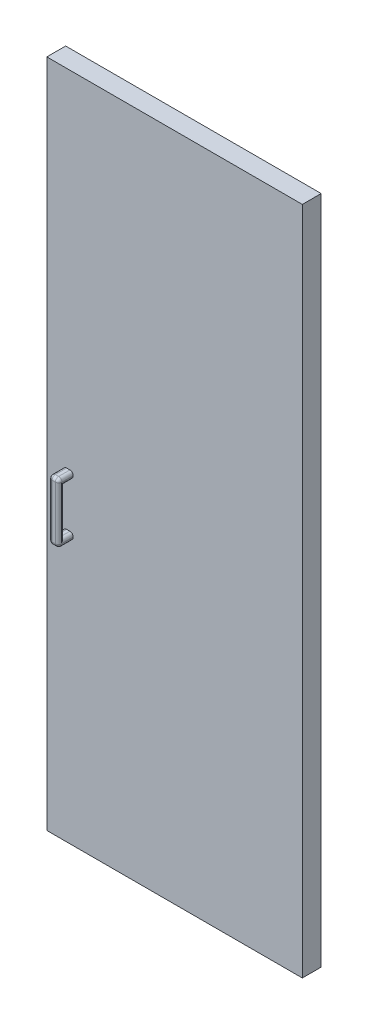
ISO-10303-21;
HEADER;
FILE_DESCRIPTION(('STEP AP214'),'2;1');
FILE_NAME('part.step','',(''),(''),'','','');
FILE_SCHEMA(('AUTOMOTIVE_DESIGN { 1 0 10303 214 1 1 1 1 }'));
ENDSEC;
DATA;
#1=APPLICATION_CONTEXT('core data for automotive mechanical design processes');
#2=APPLICATION_PROTOCOL_DEFINITION('international standard','automotive_design',2000,#1);
#3=PRODUCT_CONTEXT('',#1,'mechanical');
#4=PRODUCT('Part','Part','',(#3));
#5=PRODUCT_RELATED_PRODUCT_CATEGORY('part','',(#4));
#6=PRODUCT_DEFINITION_FORMATION('','',#4);
#7=PRODUCT_DEFINITION_CONTEXT('part definition',#1,'design');
#8=PRODUCT_DEFINITION('design','',#6,#7);
#9=PRODUCT_DEFINITION_SHAPE('','',#8);
#10=(LENGTH_UNIT() NAMED_UNIT(*) SI_UNIT(.MILLI.,.METRE.));
#11=(NAMED_UNIT(*) PLANE_ANGLE_UNIT() SI_UNIT($,.RADIAN.));
#12=(NAMED_UNIT(*) SI_UNIT($,.STERADIAN.) SOLID_ANGLE_UNIT());
#13=UNCERTAINTY_MEASURE_WITH_UNIT(LENGTH_MEASURE(1.E-05),#10,'distance_accuracy_value','');
#14=(GEOMETRIC_REPRESENTATION_CONTEXT(3) GLOBAL_UNCERTAINTY_ASSIGNED_CONTEXT((#13)) GLOBAL_UNIT_ASSIGNED_CONTEXT((#10,
#11,#12)) REPRESENTATION_CONTEXT('',''));
#15=CARTESIAN_POINT('',(0.,0.,0.));
#16=DIRECTION('',(0.,0.,1.));
#17=DIRECTION('',(1.,0.,0.));
#18=AXIS2_PLACEMENT_3D('',#15,#16,#17);
#19=CARTESIAN_POINT('',(0.,0.,0.));
#20=DIRECTION('',(0.,0.,1.));
#21=DIRECTION('',(1.,0.,0.));
#22=AXIS2_PLACEMENT_3D('',#19,#20,#21);
#23=PLANE('',#22);
#24=DIRECTION('',(-1.,0.,0.));
#25=VECTOR('',#24,1.);
#26=CARTESIAN_POINT('',(0.,446.201837212028,0.));
#27=LINE('',#26,#25);
#28=CARTESIAN_POINT('',(0.,446.201837212028,0.));
#29=VERTEX_POINT('',#28);
#30=CARTESIAN_POINT('',(-775.,446.201837212028,0.));
#31=VERTEX_POINT('',#30);
#32=EDGE_CURVE('E280',#29,#31,#27,.T.);
#33=ORIENTED_EDGE('',*,*,#32,.F.);
#34=DIRECTION('',(0.,1.,0.));
#35=VECTOR('',#34,1.);
#36=CARTESIAN_POINT('',(0.,0.,0.));
#37=LINE('',#36,#35);
#38=CARTESIAN_POINT('',(0.,-1585.79816278797,0.));
#39=VERTEX_POINT('',#38);
#40=EDGE_CURVE('E285',#39,#29,#37,.T.);
#41=ORIENTED_EDGE('',*,*,#40,.F.);
#42=DIRECTION('',(1.,0.,0.));
#43=VECTOR('',#42,1.);
#44=CARTESIAN_POINT('',(-775.,-1585.79816278797,0.));
#45=LINE('',#44,#43);
#46=CARTESIAN_POINT('',(-775.,-1585.79816278797,0.));
#47=VERTEX_POINT('',#46);
#48=EDGE_CURVE('E296',#47,#39,#45,.T.);
#49=ORIENTED_EDGE('',*,*,#48,.F.);
#50=DIRECTION('',(0.,-1.,0.));
#51=VECTOR('',#50,1.);
#52=CARTESIAN_POINT('',(-775.,446.201837212028,0.));
#53=LINE('',#52,#51);
#54=EDGE_CURVE('E294',#31,#47,#53,.T.);
#55=ORIENTED_EDGE('',*,*,#54,.F.);
#56=EDGE_LOOP('',(#33,#41,#49,#55));
#57=FACE_BOUND('',#56,.T.);
#58=DIRECTION('',(0.,1.,0.));
#59=VECTOR('',#58,1.);
#60=CARTESIAN_POINT('',(-750.,-924.798162787972,0.));
#61=LINE('',#60,#59);
#62=CARTESIAN_POINT('',(-750.,-924.798162787972,0.));
#63=VERTEX_POINT('',#62);
#64=CARTESIAN_POINT('',(-750.,-464.798162787972,0.));
#65=VERTEX_POINT('',#64);
#66=EDGE_CURVE('E244',#63,#65,#61,.T.);
#67=ORIENTED_EDGE('',*,*,#66,.F.);
#68=DIRECTION('',(-1.,0.,0.));
#69=VECTOR('',#68,1.);
#70=CARTESIAN_POINT('',(-630.,-924.798162787972,0.));
#71=LINE('',#70,#69);
#72=CARTESIAN_POINT('',(-630.,-924.798162787972,0.));
#73=VERTEX_POINT('',#72);
#74=EDGE_CURVE('E241',#73,#63,#71,.T.);
#75=ORIENTED_EDGE('',*,*,#74,.F.);
#76=DIRECTION('',(0.,-1.,0.));
#77=VECTOR('',#76,1.);
#78=CARTESIAN_POINT('',(-630.,-924.798162787972,0.));
#79=LINE('',#78,#77);
#80=CARTESIAN_POINT('',(-630.,-464.798162787972,0.));
#81=VERTEX_POINT('',#80);
#82=EDGE_CURVE('E60',#81,#73,#79,.T.);
#83=ORIENTED_EDGE('',*,*,#82,.F.);
#84=DIRECTION('',(1.,0.,0.));
#85=VECTOR('',#84,1.);
#86=CARTESIAN_POINT('',(-630.,-464.798162787972,0.));
#87=LINE('',#86,#85);
#88=EDGE_CURVE('E55',#65,#81,#87,.T.);
#89=ORIENTED_EDGE('',*,*,#88,.F.);
#90=EDGE_LOOP('',(#67,#75,#83,#89));
#91=FACE_BOUND('',#90,.T.);
#92=ADVANCED_FACE('F38',(#57,#91),#23,.F.);
#93=CARTESIAN_POINT('',(-695.,-603.798162787972,101.15));
#94=DIRECTION('',(-1.,0.,0.));
#95=DIRECTION('',(0.,-1.,0.));
#96=AXIS2_PLACEMENT_3D('',#93,#94,#95);
#97=PLANE('',#96);
#98=DIRECTION('',(0.,1.,0.));
#99=VECTOR('',#98,1.);
#100=CARTESIAN_POINT('',(-695.,-603.798162787972,57.15));
#101=LINE('',#100,#99);
#102=CARTESIAN_POINT('',(-695.,-614.798162787972,57.15));
#103=VERTEX_POINT('',#102);
#104=CARTESIAN_POINT('',(-695.,-613.798162787972,57.15));
#105=VERTEX_POINT('',#104);
#106=EDGE_CURVE('E273',#103,#105,#101,.T.);
#107=ORIENTED_EDGE('',*,*,#106,.T.);
#108=DIRECTION('',(0.,0.,-1.));
#109=VECTOR('',#108,1.);
#110=CARTESIAN_POINT('',(-695.,-613.798162787972,101.15));
#111=LINE('',#110,#109);
#112=CARTESIAN_POINT('',(-695.,-613.798162787972,91.15));
#113=VERTEX_POINT('',#112);
#114=EDGE_CURVE('E349',#105,#113,#111,.F.);
#115=ORIENTED_EDGE('',*,*,#114,.T.);
#116=DIRECTION('',(0.,1.,0.));
#117=VECTOR('',#116,1.);
#118=CARTESIAN_POINT('',(-695.,-785.798162787972,91.15));
#119=LINE('',#118,#117);
#120=CARTESIAN_POINT('',(-695.,-614.798162787972,91.15));
#121=VERTEX_POINT('',#120);
#122=EDGE_CURVE('E345',#113,#121,#119,.F.);
#123=ORIENTED_EDGE('',*,*,#122,.T.);
#124=DIRECTION('',(0.,0.,-1.));
#125=VECTOR('',#124,1.);
#126=CARTESIAN_POINT('',(-695.,-614.798162787972,101.15));
#127=LINE('',#126,#125);
#128=EDGE_CURVE('E347',#121,#103,#127,.T.);
#129=ORIENTED_EDGE('',*,*,#128,.T.);
#130=EDGE_LOOP('',(#107,#115,#123,#129));
#131=FACE_BOUND('',#130,.T.);
#132=ADVANCED_FACE('F551',(#131),#97,.F.);
#133=CARTESIAN_POINT('',(-725.,-603.798162787972,101.15));
#134=DIRECTION('',(1.,0.,0.));
#135=DIRECTION('',(0.,0.,-1.));
#136=AXIS2_PLACEMENT_3D('',#133,#134,#135);
#137=PLANE('',#136);
#138=DIRECTION('',(0.,-1.,0.));
#139=VECTOR('',#138,1.);
#140=CARTESIAN_POINT('',(-725.,-603.798162787972,91.15));
#141=LINE('',#140,#139);
#142=CARTESIAN_POINT('',(-725.,-614.798162787972,91.15));
#143=VERTEX_POINT('',#142);
#144=CARTESIAN_POINT('',(-725.,-613.798162787972,91.15));
#145=VERTEX_POINT('',#144);
#146=EDGE_CURVE('E317',#143,#145,#141,.F.);
#147=ORIENTED_EDGE('',*,*,#146,.T.);
#148=DIRECTION('',(0.,0.,-1.));
#149=VECTOR('',#148,1.);
#150=CARTESIAN_POINT('',(-725.,-613.798162787972,101.15));
#151=LINE('',#150,#149);
#152=CARTESIAN_POINT('',(-725.,-613.798162787972,57.15));
#153=VERTEX_POINT('',#152);
#154=EDGE_CURVE('E321',#145,#153,#151,.T.);
#155=ORIENTED_EDGE('',*,*,#154,.T.);
#156=DIRECTION('',(0.,-1.,0.));
#157=VECTOR('',#156,1.);
#158=CARTESIAN_POINT('',(-725.,-603.798162787972,57.15));
#159=LINE('',#158,#157);
#160=CARTESIAN_POINT('',(-725.,-614.798162787972,57.15));
#161=VERTEX_POINT('',#160);
#162=EDGE_CURVE('E269',#153,#161,#159,.T.);
#163=ORIENTED_EDGE('',*,*,#162,.T.);
#164=DIRECTION('',(0.,0.,-1.));
#165=VECTOR('',#164,1.);
#166=CARTESIAN_POINT('',(-725.,-614.798162787972,101.15));
#167=LINE('',#166,#165);
#168=EDGE_CURVE('E319',#161,#143,#167,.F.);
#169=ORIENTED_EDGE('',*,*,#168,.T.);
#170=EDGE_LOOP('',(#147,#155,#163,#169));
#171=FACE_BOUND('',#170,.T.);
#172=ADVANCED_FACE('F518',(#171),#137,.F.);
#173=CARTESIAN_POINT('',(0.,0.,57.15));
#174=DIRECTION('',(0.,0.,1.));
#175=DIRECTION('',(1.,0.,0.));
#176=AXIS2_PLACEMENT_3D('',#173,#174,#175);
#177=PLANE('',#176);
#178=ORIENTED_EDGE('',*,*,#106,.F.);
#179=CARTESIAN_POINT('',(-705.,-614.798162787972,57.15));
#180=DIRECTION('',(0.,0.,1.));
#181=DIRECTION('',(1.,0.,0.));
#182=AXIS2_PLACEMENT_3D('',#179,#180,#181);
#183=CIRCLE('',#182,10.);
#184=CARTESIAN_POINT('',(-705.,-624.798162787972,57.15));
#185=VERTEX_POINT('',#184);
#186=EDGE_CURVE('E373',#103,#185,#183,.F.);
#187=ORIENTED_EDGE('',*,*,#186,.T.);
#188=DIRECTION('',(-1.,0.,0.));
#189=VECTOR('',#188,1.);
#190=CARTESIAN_POINT('',(-667.85,-624.798162787972,57.15));
#191=LINE('',#190,#189);
#192=CARTESIAN_POINT('',(-715.,-624.798162787972,57.15));
#193=VERTEX_POINT('',#192);
#194=EDGE_CURVE('E254',#185,#193,#191,.T.);
#195=ORIENTED_EDGE('',*,*,#194,.T.);
#196=CARTESIAN_POINT('',(-715.,-614.798162787972,57.15));
#197=DIRECTION('',(0.,0.,1.));
#198=DIRECTION('',(1.,0.,0.));
#199=AXIS2_PLACEMENT_3D('',#196,#197,#198);
#200=CIRCLE('',#199,10.);
#201=EDGE_CURVE('E375',#193,#161,#200,.F.);
#202=ORIENTED_EDGE('',*,*,#201,.T.);
#203=ORIENTED_EDGE('',*,*,#162,.F.);
#204=CARTESIAN_POINT('',(-715.,-613.798162787972,57.15));
#205=DIRECTION('',(0.,0.,1.));
#206=DIRECTION('',(1.,0.,0.));
#207=AXIS2_PLACEMENT_3D('',#204,#205,#206);
#208=CIRCLE('',#207,10.);
#209=CARTESIAN_POINT('',(-715.,-603.798162787972,57.15));
#210=VERTEX_POINT('',#209);
#211=EDGE_CURVE('E369',#153,#210,#208,.F.);
#212=ORIENTED_EDGE('',*,*,#211,.T.);
#213=DIRECTION('',(-1.,0.,0.));
#214=VECTOR('',#213,1.);
#215=CARTESIAN_POINT('',(-725.,-603.798162787972,57.15));
#216=LINE('',#215,#214);
#217=CARTESIAN_POINT('',(-705.,-603.798162787972,57.15));
#218=VERTEX_POINT('',#217);
#219=EDGE_CURVE('E277',#218,#210,#216,.T.);
#220=ORIENTED_EDGE('',*,*,#219,.F.);
#221=CARTESIAN_POINT('',(-705.,-613.798162787972,57.15));
#222=DIRECTION('',(0.,0.,1.));
#223=DIRECTION('',(1.,0.,0.));
#224=AXIS2_PLACEMENT_3D('',#221,#222,#223);
#225=CIRCLE('',#224,10.);
#226=EDGE_CURVE('E371',#218,#105,#225,.F.);
#227=ORIENTED_EDGE('',*,*,#226,.T.);
#228=EDGE_LOOP('',(#178,#187,#195,#202,#203,#212,#220,#227));
#229=FACE_BOUND('',#228,.T.);
#230=DIRECTION('',(-1.,0.,0.));
#231=VECTOR('',#230,1.);
#232=CARTESIAN_POINT('',(-667.85,-764.798162787972,57.15));
#233=LINE('',#232,#231);
#234=CARTESIAN_POINT('',(-705.,-764.798162787972,57.15));
#235=VERTEX_POINT('',#234);
#236=CARTESIAN_POINT('',(-715.,-764.798162787972,57.15));
#237=VERTEX_POINT('',#236);
#238=EDGE_CURVE('E264',#235,#237,#233,.T.);
#239=ORIENTED_EDGE('',*,*,#238,.F.);
#240=CARTESIAN_POINT('',(-705.,-774.798162787972,57.15));
#241=DIRECTION('',(0.,0.,1.));
#242=DIRECTION('',(1.,0.,0.));
#243=AXIS2_PLACEMENT_3D('',#240,#241,#242);
#244=CIRCLE('',#243,10.);
#245=CARTESIAN_POINT('',(-695.,-774.798162787972,57.15));
#246=VERTEX_POINT('',#245);
#247=EDGE_CURVE('E377',#235,#246,#244,.F.);
#248=ORIENTED_EDGE('',*,*,#247,.T.);
#249=CARTESIAN_POINT('',(-695.,-775.798162787972,57.15));
#250=VERTEX_POINT('',#249);
#251=EDGE_CURVE('E274',#250,#246,#101,.T.);
#252=ORIENTED_EDGE('',*,*,#251,.F.);
#253=CARTESIAN_POINT('',(-705.,-775.798162787972,57.15));
#254=DIRECTION('',(0.,0.,1.));
#255=DIRECTION('',(1.,0.,0.));
#256=AXIS2_PLACEMENT_3D('',#253,#254,#255);
#257=CIRCLE('',#256,10.);
#258=CARTESIAN_POINT('',(-705.,-785.798162787972,57.15));
#259=VERTEX_POINT('',#258);
#260=EDGE_CURVE('E11',#250,#259,#257,.F.);
#261=ORIENTED_EDGE('',*,*,#260,.T.);
#262=DIRECTION('',(1.,0.,0.));
#263=VECTOR('',#262,1.);
#264=CARTESIAN_POINT('',(-725.,-785.798162787972,57.15));
#265=LINE('',#264,#263);
#266=CARTESIAN_POINT('',(-715.,-785.798162787972,57.15));
#267=VERTEX_POINT('',#266);
#268=EDGE_CURVE('E270',#267,#259,#265,.T.);
#269=ORIENTED_EDGE('',*,*,#268,.F.);
#270=CARTESIAN_POINT('',(-715.,-775.798162787972,57.15));
#271=DIRECTION('',(0.,0.,1.));
#272=DIRECTION('',(1.,0.,0.));
#273=AXIS2_PLACEMENT_3D('',#270,#271,#272);
#274=CIRCLE('',#273,10.);
#275=CARTESIAN_POINT('',(-725.,-775.798162787972,57.15));
#276=VERTEX_POINT('',#275);
#277=EDGE_CURVE('E47',#267,#276,#274,.F.);
#278=ORIENTED_EDGE('',*,*,#277,.T.);
#279=CARTESIAN_POINT('',(-725.,-774.798162787972,57.15));
#280=VERTEX_POINT('',#279);
#281=EDGE_CURVE('E257',#280,#276,#159,.T.);
#282=ORIENTED_EDGE('',*,*,#281,.F.);
#283=CARTESIAN_POINT('',(-715.,-774.798162787972,57.15));
#284=DIRECTION('',(0.,0.,1.));
#285=DIRECTION('',(1.,0.,0.));
#286=AXIS2_PLACEMENT_3D('',#283,#284,#285);
#287=CIRCLE('',#286,10.);
#288=EDGE_CURVE('E379',#280,#237,#287,.F.);
#289=ORIENTED_EDGE('',*,*,#288,.T.);
#290=EDGE_LOOP('',(#239,#248,#252,#261,#269,#278,#282,#289));
#291=FACE_BOUND('',#290,.T.);
#292=DIRECTION('',(-1.,0.,0.));
#293=VECTOR('',#292,1.);
#294=CARTESIAN_POINT('',(0.,446.201837212028,57.15));
#295=LINE('',#294,#293);
#296=CARTESIAN_POINT('',(0.,446.201837212028,57.15));
#297=VERTEX_POINT('',#296);
#298=CARTESIAN_POINT('',(-775.,446.201837212028,57.15));
#299=VERTEX_POINT('',#298);
#300=EDGE_CURVE('E281',#297,#299,#295,.T.);
#301=ORIENTED_EDGE('',*,*,#300,.T.);
#302=DIRECTION('',(0.,-1.,0.));
#303=VECTOR('',#302,1.);
#304=CARTESIAN_POINT('',(-775.,446.201837212028,57.15));
#305=LINE('',#304,#303);
#306=CARTESIAN_POINT('',(-775.,-1585.79816278797,57.15));
#307=VERTEX_POINT('',#306);
#308=EDGE_CURVE('E284',#299,#307,#305,.T.);
#309=ORIENTED_EDGE('',*,*,#308,.T.);
#310=DIRECTION('',(1.,0.,0.));
#311=VECTOR('',#310,1.);
#312=CARTESIAN_POINT('',(-775.,-1585.79816278797,57.15));
#313=LINE('',#312,#311);
#314=CARTESIAN_POINT('',(0.,-1585.79816278797,57.15));
#315=VERTEX_POINT('',#314);
#316=EDGE_CURVE('E287',#307,#315,#313,.T.);
#317=ORIENTED_EDGE('',*,*,#316,.T.);
#318=DIRECTION('',(0.,1.,0.));
#319=VECTOR('',#318,1.);
#320=CARTESIAN_POINT('',(0.,-1585.79816278797,57.15));
#321=LINE('',#320,#319);
#322=EDGE_CURVE('E289',#315,#297,#321,.T.);
#323=ORIENTED_EDGE('',*,*,#322,.T.);
#324=EDGE_LOOP('',(#301,#309,#317,#323));
#325=FACE_BOUND('',#324,.T.);
#326=ADVANCED_FACE('F464',(#229,#291,#325),#177,.T.);
#327=CARTESIAN_POINT('',(0.,446.201837212028,57.15));
#328=DIRECTION('',(0.,-1.,0.));
#329=DIRECTION('',(1.,0.,0.));
#330=AXIS2_PLACEMENT_3D('',#327,#328,#329);
#331=PLANE('',#330);
#332=ORIENTED_EDGE('',*,*,#32,.T.);
#333=DIRECTION('',(0.,0.,-1.));
#334=VECTOR('',#333,1.);
#335=CARTESIAN_POINT('',(-775.,446.201837212028,57.15));
#336=LINE('',#335,#334);
#337=EDGE_CURVE('E308',#299,#31,#336,.T.);
#338=ORIENTED_EDGE('',*,*,#337,.F.);
#339=ORIENTED_EDGE('',*,*,#300,.F.);
#340=DIRECTION('',(0.,0.,-1.));
#341=VECTOR('',#340,1.);
#342=CARTESIAN_POINT('',(0.,446.201837212028,57.15));
#343=LINE('',#342,#341);
#344=EDGE_CURVE('E291',#297,#29,#343,.T.);
#345=ORIENTED_EDGE('',*,*,#344,.T.);
#346=EDGE_LOOP('',(#332,#338,#339,#345));
#347=FACE_BOUND('',#346,.T.);
#348=ADVANCED_FACE('F574',(#347),#331,.F.);
#349=CARTESIAN_POINT('',(-775.,446.201837212028,57.15));
#350=DIRECTION('',(1.,0.,0.));
#351=DIRECTION('',(0.,1.,0.));
#352=AXIS2_PLACEMENT_3D('',#349,#350,#351);
#353=PLANE('',#352);
#354=ORIENTED_EDGE('',*,*,#54,.T.);
#355=DIRECTION('',(0.,0.,-1.));
#356=VECTOR('',#355,1.);
#357=CARTESIAN_POINT('',(-775.,-1585.79816278797,57.15));
#358=LINE('',#357,#356);
#359=EDGE_CURVE('E305',#307,#47,#358,.T.);
#360=ORIENTED_EDGE('',*,*,#359,.F.);
#361=ORIENTED_EDGE('',*,*,#308,.F.);
#362=ORIENTED_EDGE('',*,*,#337,.T.);
#363=EDGE_LOOP('',(#354,#360,#361,#362));
#364=FACE_BOUND('',#363,.T.);
#365=ADVANCED_FACE('F582',(#364),#353,.F.);
#366=CARTESIAN_POINT('',(-775.,-1585.79816278797,57.15));
#367=DIRECTION('',(0.,1.,0.));
#368=DIRECTION('',(0.,0.,1.));
#369=AXIS2_PLACEMENT_3D('',#366,#367,#368);
#370=PLANE('',#369);
#371=ORIENTED_EDGE('',*,*,#48,.T.);
#372=DIRECTION('',(0.,0.,-1.));
#373=VECTOR('',#372,1.);
#374=CARTESIAN_POINT('',(0.,-1585.79816278797,57.15));
#375=LINE('',#374,#373);
#376=EDGE_CURVE('E302',#315,#39,#375,.T.);
#377=ORIENTED_EDGE('',*,*,#376,.F.);
#378=ORIENTED_EDGE('',*,*,#316,.F.);
#379=ORIENTED_EDGE('',*,*,#359,.T.);
#380=EDGE_LOOP('',(#371,#377,#378,#379));
#381=FACE_BOUND('',#380,.T.);
#382=ADVANCED_FACE('F578',(#381),#370,.F.);
#383=CARTESIAN_POINT('',(0.,0.,57.15));
#384=DIRECTION('',(-1.,0.,0.));
#385=DIRECTION('',(0.,0.,1.));
#386=AXIS2_PLACEMENT_3D('',#383,#384,#385);
#387=PLANE('',#386);
#388=ORIENTED_EDGE('',*,*,#40,.T.);
#389=ORIENTED_EDGE('',*,*,#344,.F.);
#390=ORIENTED_EDGE('',*,*,#322,.F.);
#391=ORIENTED_EDGE('',*,*,#376,.T.);
#392=EDGE_LOOP('',(#388,#389,#390,#391));
#393=FACE_BOUND('',#392,.T.);
#394=ADVANCED_FACE('F571',(#393),#387,.F.);
#395=DIRECTION('',(0.,-1.,0.));
#396=VECTOR('',#395,1.);
#397=CARTESIAN_POINT('',(-725.,-603.798162787972,91.15));
#398=LINE('',#397,#396);
#399=CARTESIAN_POINT('',(-725.,-775.798162787972,91.15));
#400=VERTEX_POINT('',#399);
#401=CARTESIAN_POINT('',(-725.,-774.798162787972,91.15));
#402=VERTEX_POINT('',#401);
#403=EDGE_CURVE('E313',#400,#402,#398,.F.);
#404=ORIENTED_EDGE('',*,*,#403,.T.);
#405=DIRECTION('',(0.,0.,1.));
#406=VECTOR('',#405,1.);
#407=CARTESIAN_POINT('',(-725.,-774.798162787972,101.15));
#408=LINE('',#407,#406);
#409=EDGE_CURVE('E315',#402,#280,#408,.F.);
#410=ORIENTED_EDGE('',*,*,#409,.T.);
#411=ORIENTED_EDGE('',*,*,#281,.T.);
#412=DIRECTION('',(0.,0.,-1.));
#413=VECTOR('',#412,1.);
#414=CARTESIAN_POINT('',(-725.,-775.798162787972,101.15));
#415=LINE('',#414,#413);
#416=EDGE_CURVE('E311',#276,#400,#415,.F.);
#417=ORIENTED_EDGE('',*,*,#416,.T.);
#418=EDGE_LOOP('',(#404,#410,#411,#417));
#419=FACE_BOUND('',#418,.T.);
#420=ADVANCED_FACE('F484',(#419),#137,.F.);
#421=CARTESIAN_POINT('',(-725.,-785.798162787972,101.15));
#422=DIRECTION('',(0.,1.,0.));
#423=DIRECTION('',(0.,0.,1.));
#424=AXIS2_PLACEMENT_3D('',#421,#422,#423);
#425=PLANE('',#424);
#426=DIRECTION('',(1.,0.,0.));
#427=VECTOR('',#426,1.);
#428=CARTESIAN_POINT('',(-725.,-785.798162787972,91.15));
#429=LINE('',#428,#427);
#430=CARTESIAN_POINT('',(-705.,-785.798162787972,91.15));
#431=VERTEX_POINT('',#430);
#432=CARTESIAN_POINT('',(-715.,-785.798162787972,91.15));
#433=VERTEX_POINT('',#432);
#434=EDGE_CURVE('E363',#431,#433,#429,.F.);
#435=ORIENTED_EDGE('',*,*,#434,.T.);
#436=DIRECTION('',(0.,0.,-1.));
#437=VECTOR('',#436,1.);
#438=CARTESIAN_POINT('',(-715.,-785.798162787972,101.15));
#439=LINE('',#438,#437);
#440=EDGE_CURVE('E367',#433,#267,#439,.T.);
#441=ORIENTED_EDGE('',*,*,#440,.T.);
#442=ORIENTED_EDGE('',*,*,#268,.T.);
#443=DIRECTION('',(0.,0.,-1.));
#444=VECTOR('',#443,1.);
#445=CARTESIAN_POINT('',(-705.,-785.798162787972,101.15));
#446=LINE('',#445,#444);
#447=EDGE_CURVE('E365',#259,#431,#446,.F.);
#448=ORIENTED_EDGE('',*,*,#447,.T.);
#449=EDGE_LOOP('',(#435,#441,#442,#448));
#450=FACE_BOUND('',#449,.T.);
#451=ADVANCED_FACE('F472',(#450),#425,.F.);
#452=ORIENTED_EDGE('',*,*,#251,.T.);
#453=DIRECTION('',(0.,0.,1.));
#454=VECTOR('',#453,1.);
#455=CARTESIAN_POINT('',(-695.,-774.798162787972,101.15));
#456=LINE('',#455,#454);
#457=CARTESIAN_POINT('',(-695.,-774.798162787972,91.15));
#458=VERTEX_POINT('',#457);
#459=EDGE_CURVE('E343',#246,#458,#456,.T.);
#460=ORIENTED_EDGE('',*,*,#459,.T.);
#461=DIRECTION('',(0.,1.,0.));
#462=VECTOR('',#461,1.);
#463=CARTESIAN_POINT('',(-695.,-785.798162787972,91.15));
#464=LINE('',#463,#462);
#465=CARTESIAN_POINT('',(-695.,-775.798162787972,91.15));
#466=VERTEX_POINT('',#465);
#467=EDGE_CURVE('E339',#458,#466,#464,.F.);
#468=ORIENTED_EDGE('',*,*,#467,.T.);
#469=DIRECTION('',(0.,0.,-1.));
#470=VECTOR('',#469,1.);
#471=CARTESIAN_POINT('',(-695.,-775.798162787972,101.15));
#472=LINE('',#471,#470);
#473=EDGE_CURVE('E341',#466,#250,#472,.T.);
#474=ORIENTED_EDGE('',*,*,#473,.T.);
#475=EDGE_LOOP('',(#452,#460,#468,#474));
#476=FACE_BOUND('',#475,.T.);
#477=ADVANCED_FACE('F458',(#476),#97,.F.);
#478=CARTESIAN_POINT('',(-725.,-603.798162787972,101.15));
#479=DIRECTION('',(0.,-1.,0.));
#480=DIRECTION('',(1.,0.,0.));
#481=AXIS2_PLACEMENT_3D('',#478,#479,#480);
#482=PLANE('',#481);
#483=ORIENTED_EDGE('',*,*,#219,.T.);
#484=DIRECTION('',(0.,0.,-1.));
#485=VECTOR('',#484,1.);
#486=CARTESIAN_POINT('',(-715.,-603.798162787972,101.15));
#487=LINE('',#486,#485);
#488=CARTESIAN_POINT('',(-715.,-603.798162787972,91.15));
#489=VERTEX_POINT('',#488);
#490=EDGE_CURVE('E328',#210,#489,#487,.F.);
#491=ORIENTED_EDGE('',*,*,#490,.T.);
#492=DIRECTION('',(-1.,0.,0.));
#493=VECTOR('',#492,1.);
#494=CARTESIAN_POINT('',(-695.,-603.798162787972,91.15));
#495=LINE('',#494,#493);
#496=CARTESIAN_POINT('',(-705.,-603.798162787972,91.15));
#497=VERTEX_POINT('',#496);
#498=EDGE_CURVE('E326',#489,#497,#495,.F.);
#499=ORIENTED_EDGE('',*,*,#498,.T.);
#500=DIRECTION('',(0.,0.,-1.));
#501=VECTOR('',#500,1.);
#502=CARTESIAN_POINT('',(-705.,-603.798162787972,101.15));
#503=LINE('',#502,#501);
#504=EDGE_CURVE('E324',#497,#218,#503,.T.);
#505=ORIENTED_EDGE('',*,*,#504,.T.);
#506=EDGE_LOOP('',(#483,#491,#499,#505));
#507=FACE_BOUND('',#506,.T.);
#508=ADVANCED_FACE('F529',(#507),#482,.F.);
#509=CARTESIAN_POINT('',(0.,0.,101.15));
#510=DIRECTION('',(0.,0.,1.));
#511=DIRECTION('',(1.,0.,0.));
#512=AXIS2_PLACEMENT_3D('',#509,#510,#511);
#513=PLANE('',#512);
#514=DIRECTION('',(0.,1.,0.));
#515=VECTOR('',#514,1.);
#516=CARTESIAN_POINT('',(-705.,-603.798162787972,101.15));
#517=LINE('',#516,#515);
#518=CARTESIAN_POINT('',(-705.,-775.798162787972,101.15));
#519=VERTEX_POINT('',#518);
#520=CARTESIAN_POINT('',(-705.,-613.798162787972,101.15));
#521=VERTEX_POINT('',#520);
#522=EDGE_CURVE('E332',#519,#521,#517,.T.);
#523=ORIENTED_EDGE('',*,*,#522,.T.);
#524=DIRECTION('',(-1.,0.,0.));
#525=VECTOR('',#524,1.);
#526=CARTESIAN_POINT('',(-725.,-613.798162787972,101.15));
#527=LINE('',#526,#525);
#528=CARTESIAN_POINT('',(-715.,-613.798162787972,101.15));
#529=VERTEX_POINT('',#528);
#530=EDGE_CURVE('E336',#521,#529,#527,.T.);
#531=ORIENTED_EDGE('',*,*,#530,.T.);
#532=DIRECTION('',(0.,-1.,0.));
#533=VECTOR('',#532,1.);
#534=CARTESIAN_POINT('',(-715.,-785.798162787972,101.15));
#535=LINE('',#534,#533);
#536=CARTESIAN_POINT('',(-715.,-775.798162787972,101.15));
#537=VERTEX_POINT('',#536);
#538=EDGE_CURVE('E334',#529,#537,#535,.T.);
#539=ORIENTED_EDGE('',*,*,#538,.T.);
#540=DIRECTION('',(1.,0.,0.));
#541=VECTOR('',#540,1.);
#542=CARTESIAN_POINT('',(-695.,-775.798162787972,101.15));
#543=LINE('',#542,#541);
#544=EDGE_CURVE('E330',#537,#519,#543,.T.);
#545=ORIENTED_EDGE('',*,*,#544,.T.);
#546=EDGE_LOOP('',(#523,#531,#539,#545));
#547=FACE_BOUND('',#546,.T.);
#548=ADVANCED_FACE('F546',(#547),#513,.T.);
#549=CARTESIAN_POINT('',(-667.85,-624.798162787972,83.15));
#550=DIRECTION('',(0.,1.,0.));
#551=DIRECTION('',(0.,0.,1.));
#552=AXIS2_PLACEMENT_3D('',#549,#550,#551);
#553=PLANE('',#552);
#554=ORIENTED_EDGE('',*,*,#194,.F.);
#555=DIRECTION('',(0.,0.,-1.));
#556=VECTOR('',#555,1.);
#557=CARTESIAN_POINT('',(-705.,-624.798162787972,83.15));
#558=LINE('',#557,#556);
#559=CARTESIAN_POINT('',(-705.,-624.798162787972,83.15));
#560=VERTEX_POINT('',#559);
#561=EDGE_CURVE('E353',#185,#560,#558,.F.);
#562=ORIENTED_EDGE('',*,*,#561,.T.);
#563=DIRECTION('',(-1.,0.,0.));
#564=VECTOR('',#563,1.);
#565=CARTESIAN_POINT('',(-667.85,-624.798162787972,83.15));
#566=LINE('',#565,#564);
#567=CARTESIAN_POINT('',(-715.,-624.798162787972,83.15));
#568=VERTEX_POINT('',#567);
#569=EDGE_CURVE('E258',#560,#568,#566,.T.);
#570=ORIENTED_EDGE('',*,*,#569,.T.);
#571=DIRECTION('',(0.,0.,-1.));
#572=VECTOR('',#571,1.);
#573=CARTESIAN_POINT('',(-715.,-624.798162787972,83.15));
#574=LINE('',#573,#572);
#575=EDGE_CURVE('E351',#568,#193,#574,.T.);
#576=ORIENTED_EDGE('',*,*,#575,.T.);
#577=EDGE_LOOP('',(#554,#562,#570,#576));
#578=FACE_BOUND('',#577,.T.);
#579=ADVANCED_FACE('F503',(#578),#553,.F.);
#580=CARTESIAN_POINT('',(-667.85,-764.798162787972,83.15));
#581=DIRECTION('',(0.,0.,1.));
#582=DIRECTION('',(1.,0.,0.));
#583=AXIS2_PLACEMENT_3D('',#580,#581,#582);
#584=PLANE('',#583);
#585=ORIENTED_EDGE('',*,*,#569,.F.);
#586=DIRECTION('',(0.,1.,0.));
#587=VECTOR('',#586,1.);
#588=CARTESIAN_POINT('',(-705.,-764.798162787972,83.15));
#589=LINE('',#588,#587);
#590=CARTESIAN_POINT('',(-705.,-764.798162787972,83.15));
#591=VERTEX_POINT('',#590);
#592=EDGE_CURVE('E357',#560,#591,#589,.F.);
#593=ORIENTED_EDGE('',*,*,#592,.T.);
#594=DIRECTION('',(-1.,0.,0.));
#595=VECTOR('',#594,1.);
#596=CARTESIAN_POINT('',(-667.85,-764.798162787972,83.15));
#597=LINE('',#596,#595);
#598=CARTESIAN_POINT('',(-715.,-764.798162787972,83.15));
#599=VERTEX_POINT('',#598);
#600=EDGE_CURVE('E261',#591,#599,#597,.T.);
#601=ORIENTED_EDGE('',*,*,#600,.T.);
#602=DIRECTION('',(0.,1.,0.));
#603=VECTOR('',#602,1.);
#604=CARTESIAN_POINT('',(-715.,-764.798162787972,83.15));
#605=LINE('',#604,#603);
#606=EDGE_CURVE('E355',#599,#568,#605,.T.);
#607=ORIENTED_EDGE('',*,*,#606,.T.);
#608=EDGE_LOOP('',(#585,#593,#601,#607));
#609=FACE_BOUND('',#608,.T.);
#610=ADVANCED_FACE('F499',(#609),#584,.F.);
#611=CARTESIAN_POINT('',(-667.85,-764.798162787972,57.15));
#612=DIRECTION('',(0.,-1.,0.));
#613=DIRECTION('',(0.,0.,-1.));
#614=AXIS2_PLACEMENT_3D('',#611,#612,#613);
#615=PLANE('',#614);
#616=ORIENTED_EDGE('',*,*,#600,.F.);
#617=DIRECTION('',(0.,0.,1.));
#618=VECTOR('',#617,1.);
#619=CARTESIAN_POINT('',(-705.,-764.798162787972,57.15));
#620=LINE('',#619,#618);
#621=EDGE_CURVE('E361',#591,#235,#620,.F.);
#622=ORIENTED_EDGE('',*,*,#621,.T.);
#623=ORIENTED_EDGE('',*,*,#238,.T.);
#624=DIRECTION('',(0.,0.,1.));
#625=VECTOR('',#624,1.);
#626=CARTESIAN_POINT('',(-715.,-764.798162787972,57.15));
#627=LINE('',#626,#625);
#628=EDGE_CURVE('E359',#237,#599,#627,.T.);
#629=ORIENTED_EDGE('',*,*,#628,.T.);
#630=EDGE_LOOP('',(#616,#622,#623,#629));
#631=FACE_BOUND('',#630,.T.);
#632=ADVANCED_FACE('F496',(#631),#615,.F.);
#633=CARTESIAN_POINT('',(-705.,-775.798162787972,101.15));
#634=DIRECTION('',(0.,0.,-1.));
#635=DIRECTION('',(-1.,0.,0.));
#636=AXIS2_PLACEMENT_3D('',#633,#634,#635);
#637=CYLINDRICAL_SURFACE('',#636,10.);
#638=ORIENTED_EDGE('',*,*,#260,.F.);
#639=ORIENTED_EDGE('',*,*,#473,.F.);
#640=CARTESIAN_POINT('',(-705.,-775.798162787972,91.15));
#641=DIRECTION('',(0.,0.,1.));
#642=DIRECTION('',(1.,0.,0.));
#643=AXIS2_PLACEMENT_3D('',#640,#641,#642);
#644=CIRCLE('',#643,10.);
#645=EDGE_CURVE('E432',#431,#466,#644,.T.);
#646=ORIENTED_EDGE('',*,*,#645,.F.);
#647=ORIENTED_EDGE('',*,*,#447,.F.);
#648=EDGE_LOOP('',(#638,#639,#646,#647));
#649=FACE_BOUND('',#648,.T.);
#650=ADVANCED_FACE('F40',(#649),#637,.T.);
#651=CARTESIAN_POINT('',(-705.,-614.798162787972,101.15));
#652=DIRECTION('',(0.,0.,-1.));
#653=DIRECTION('',(-1.,0.,0.));
#654=AXIS2_PLACEMENT_3D('',#651,#652,#653);
#655=CYLINDRICAL_SURFACE('',#654,10.);
#656=CARTESIAN_POINT('',(-705.,-614.798162787972,93.15));
#657=DIRECTION('',(0.,0.707106781186547,-0.707106781186547));
#658=DIRECTION('',(0.,-0.707106781186547,-0.707106781186547));
#659=AXIS2_PLACEMENT_3D('',#656,#657,#658);
#660=ELLIPSE('',#659,14.1421356237309,10.);
#661=CARTESIAN_POINT('',(-695.050125628934,-615.798162787972,92.1499999999994));
#662=VERTEX_POINT('',#661);
#663=EDGE_CURVE('E42',#560,#662,#660,.F.);
#664=ORIENTED_EDGE('',*,*,#663,.F.);
#665=ORIENTED_EDGE('',*,*,#561,.F.);
#666=ORIENTED_EDGE('',*,*,#186,.F.);
#667=ORIENTED_EDGE('',*,*,#128,.F.);
#668=CARTESIAN_POINT('',(-705.,-614.798162787972,91.15));
#669=DIRECTION('',(0.,-0.707106781186547,-0.707106781186547));
#670=DIRECTION('',(0.,0.707106781186547,-0.707106781186547));
#671=AXIS2_PLACEMENT_3D('',#668,#669,#670);
#672=ELLIPSE('',#671,14.1421356237309,10.);
#673=EDGE_CURVE('E429',#662,#121,#672,.F.);
#674=ORIENTED_EDGE('',*,*,#673,.F.);
#675=EDGE_LOOP('',(#664,#665,#666,#667,#674));
#676=FACE_BOUND('',#675,.T.);
#677=ADVANCED_FACE('F448',(#676),#655,.T.);
#678=CARTESIAN_POINT('',(-705.,-603.798162787972,93.15));
#679=DIRECTION('',(0.,1.,0.));
#680=DIRECTION('',(-1.,0.,0.));
#681=AXIS2_PLACEMENT_3D('',#678,#679,#680);
#682=CYLINDRICAL_SURFACE('',#681,10.);
#683=CARTESIAN_POINT('',(-705.,-774.798162787972,93.15));
#684=DIRECTION('',(0.,0.707106781186547,0.707106781186547));
#685=DIRECTION('',(0.,0.707106781186547,-0.707106781186547));
#686=AXIS2_PLACEMENT_3D('',#683,#684,#685);
#687=ELLIPSE('',#686,14.1421356237309,10.);
#688=CARTESIAN_POINT('',(-695.050125628934,-773.798162787972,92.15));
#689=VERTEX_POINT('',#688);
#690=EDGE_CURVE('E434',#591,#689,#687,.F.);
#691=ORIENTED_EDGE('',*,*,#690,.F.);
#692=ORIENTED_EDGE('',*,*,#592,.F.);
#693=ORIENTED_EDGE('',*,*,#663,.T.);
#694=DIRECTION('',(0.,-1.,0.));
#695=VECTOR('',#694,1.);
#696=CARTESIAN_POINT('',(-695.050125628934,-694.798162787972,92.1499999999994));
#697=LINE('',#696,#695);
#698=EDGE_CURVE('E426',#689,#662,#697,.F.);
#699=ORIENTED_EDGE('',*,*,#698,.F.);
#700=EDGE_LOOP('',(#691,#692,#693,#699));
#701=FACE_BOUND('',#700,.T.);
#702=ADVANCED_FACE('F444',(#701),#682,.T.);
#703=CARTESIAN_POINT('',(-705.,-774.798162787972,101.15));
#704=DIRECTION('',(0.,0.,1.));
#705=DIRECTION('',(1.,0.,0.));
#706=AXIS2_PLACEMENT_3D('',#703,#704,#705);
#707=CYLINDRICAL_SURFACE('',#706,10.);
#708=ORIENTED_EDGE('',*,*,#621,.F.);
#709=ORIENTED_EDGE('',*,*,#690,.T.);
#710=CARTESIAN_POINT('',(-705.,-774.798162787972,91.15));
#711=DIRECTION('',(0.,-0.707106781186547,0.707106781186547));
#712=DIRECTION('',(0.,0.707106781186547,0.707106781186547));
#713=AXIS2_PLACEMENT_3D('',#710,#711,#712);
#714=ELLIPSE('',#713,14.1421356237309,10.);
#715=EDGE_CURVE('E423',#458,#689,#714,.T.);
#716=ORIENTED_EDGE('',*,*,#715,.F.);
#717=ORIENTED_EDGE('',*,*,#459,.F.);
#718=ORIENTED_EDGE('',*,*,#247,.F.);
#719=EDGE_LOOP('',(#708,#709,#716,#717,#718));
#720=FACE_BOUND('',#719,.T.);
#721=ADVANCED_FACE('F455',(#720),#707,.T.);
#722=CARTESIAN_POINT('',(-705.,-775.798162787972,91.15));
#723=DIRECTION('',(1.,0.,0.));
#724=DIRECTION('',(0.,0.,-1.));
#725=AXIS2_PLACEMENT_3D('',#722,#723,#724);
#726=SPHERICAL_SURFACE('',#725,10.);
#727=CARTESIAN_POINT('',(-705.,-775.798162787972,91.15));
#728=DIRECTION('',(1.,0.,0.));
#729=DIRECTION('',(0.,0.,-1.));
#730=AXIS2_PLACEMENT_3D('',#727,#728,#729);
#731=CIRCLE('',#730,10.);
#732=EDGE_CURVE('E417',#431,#519,#731,.F.);
#733=ORIENTED_EDGE('',*,*,#732,.F.);
#734=ORIENTED_EDGE('',*,*,#645,.T.);
#735=CARTESIAN_POINT('',(-705.,-775.798162787972,91.15));
#736=DIRECTION('',(0.,-1.,0.));
#737=DIRECTION('',(0.,0.,-1.));
#738=AXIS2_PLACEMENT_3D('',#735,#736,#737);
#739=CIRCLE('',#738,10.);
#740=EDGE_CURVE('E420',#519,#466,#739,.F.);
#741=ORIENTED_EDGE('',*,*,#740,.F.);
#742=EDGE_LOOP('',(#733,#734,#741));
#743=FACE_BOUND('',#742,.T.);
#744=ADVANCED_FACE('F624',(#743),#726,.T.);
#745=CARTESIAN_POINT('',(-705.,-613.798162787972,101.15));
#746=DIRECTION('',(0.,0.,-1.));
#747=DIRECTION('',(-1.,0.,0.));
#748=AXIS2_PLACEMENT_3D('',#745,#746,#747);
#749=CYLINDRICAL_SURFACE('',#748,10.);
#750=ORIENTED_EDGE('',*,*,#226,.F.);
#751=ORIENTED_EDGE('',*,*,#504,.F.);
#752=CARTESIAN_POINT('',(-705.,-613.798162787972,91.15));
#753=DIRECTION('',(0.,0.,1.));
#754=DIRECTION('',(1.,0.,0.));
#755=AXIS2_PLACEMENT_3D('',#752,#753,#754);
#756=CIRCLE('',#755,10.);
#757=EDGE_CURVE('E414',#113,#497,#756,.T.);
#758=ORIENTED_EDGE('',*,*,#757,.F.);
#759=ORIENTED_EDGE('',*,*,#114,.F.);
#760=EDGE_LOOP('',(#750,#751,#758,#759));
#761=FACE_BOUND('',#760,.T.);
#762=ADVANCED_FACE('F534',(#761),#749,.T.);
#763=CARTESIAN_POINT('',(-704.999999999999,4.30058918879524E-13,91.15));
#764=DIRECTION('',(0.,-1.,0.));
#765=DIRECTION('',(1.,0.,0.));
#766=AXIS2_PLACEMENT_3D('',#763,#764,#765);
#767=CYLINDRICAL_SURFACE('',#766,10.);
#768=ORIENTED_EDGE('',*,*,#673,.T.);
#769=ORIENTED_EDGE('',*,*,#122,.F.);
#770=CARTESIAN_POINT('',(-705.,-613.798162787972,91.15));
#771=DIRECTION('',(0.,1.,0.));
#772=DIRECTION('',(0.,0.,1.));
#773=AXIS2_PLACEMENT_3D('',#770,#771,#772);
#774=CIRCLE('',#773,10.);
#775=EDGE_CURVE('E411',#521,#113,#774,.T.);
#776=ORIENTED_EDGE('',*,*,#775,.F.);
#777=ORIENTED_EDGE('',*,*,#522,.F.);
#778=ORIENTED_EDGE('',*,*,#740,.T.);
#779=ORIENTED_EDGE('',*,*,#467,.F.);
#780=ORIENTED_EDGE('',*,*,#715,.T.);
#781=ORIENTED_EDGE('',*,*,#698,.T.);
#782=EDGE_LOOP('',(#768,#769,#776,#777,#778,#779,#780,#781));
#783=FACE_BOUND('',#782,.T.);
#784=ADVANCED_FACE('F452',(#783),#767,.T.);
#785=CARTESIAN_POINT('',(0.,-775.798162787972,91.15));
#786=DIRECTION('',(-1.,0.,0.));
#787=DIRECTION('',(0.,0.,1.));
#788=AXIS2_PLACEMENT_3D('',#785,#786,#787);
#789=CYLINDRICAL_SURFACE('',#788,10.);
#790=ORIENTED_EDGE('',*,*,#732,.T.);
#791=ORIENTED_EDGE('',*,*,#544,.F.);
#792=CARTESIAN_POINT('',(-715.,-775.798162787972,91.15));
#793=DIRECTION('',(-1.,0.,0.));
#794=DIRECTION('',(0.,0.,1.));
#795=AXIS2_PLACEMENT_3D('',#792,#793,#794);
#796=CIRCLE('',#795,10.);
#797=EDGE_CURVE('E408',#433,#537,#796,.T.);
#798=ORIENTED_EDGE('',*,*,#797,.F.);
#799=ORIENTED_EDGE('',*,*,#434,.F.);
#800=EDGE_LOOP('',(#790,#791,#798,#799));
#801=FACE_BOUND('',#800,.T.);
#802=ADVANCED_FACE('F616',(#801),#789,.T.);
#803=CARTESIAN_POINT('',(-715.,-775.798162787972,101.15));
#804=DIRECTION('',(0.,0.,-1.));
#805=DIRECTION('',(-1.,0.,0.));
#806=AXIS2_PLACEMENT_3D('',#803,#804,#805);
#807=CYLINDRICAL_SURFACE('',#806,10.);
#808=ORIENTED_EDGE('',*,*,#277,.F.);
#809=ORIENTED_EDGE('',*,*,#440,.F.);
#810=CARTESIAN_POINT('',(-715.,-775.798162787972,91.15));
#811=DIRECTION('',(0.,0.,1.));
#812=DIRECTION('',(1.,0.,0.));
#813=AXIS2_PLACEMENT_3D('',#810,#811,#812);
#814=CIRCLE('',#813,10.);
#815=EDGE_CURVE('E405',#400,#433,#814,.T.);
#816=ORIENTED_EDGE('',*,*,#815,.F.);
#817=ORIENTED_EDGE('',*,*,#416,.F.);
#818=EDGE_LOOP('',(#808,#809,#816,#817));
#819=FACE_BOUND('',#818,.T.);
#820=ADVANCED_FACE('F479',(#819),#807,.T.);
#821=CARTESIAN_POINT('',(-705.,-613.798162787972,91.15));
#822=DIRECTION('',(1.,0.,0.));
#823=DIRECTION('',(0.,0.,-1.));
#824=AXIS2_PLACEMENT_3D('',#821,#822,#823);
#825=SPHERICAL_SURFACE('',#824,10.);
#826=ORIENTED_EDGE('',*,*,#775,.T.);
#827=ORIENTED_EDGE('',*,*,#757,.T.);
#828=CARTESIAN_POINT('',(-705.,-613.798162787972,91.15));
#829=DIRECTION('',(1.,0.,0.));
#830=DIRECTION('',(0.,0.,-1.));
#831=AXIS2_PLACEMENT_3D('',#828,#829,#830);
#832=CIRCLE('',#831,10.);
#833=EDGE_CURVE('E398',#521,#497,#832,.F.);
#834=ORIENTED_EDGE('',*,*,#833,.F.);
#835=EDGE_LOOP('',(#826,#827,#834));
#836=FACE_BOUND('',#835,.T.);
#837=ADVANCED_FACE('F538',(#836),#825,.T.);
#838=CARTESIAN_POINT('',(-715.,-775.798162787972,91.15));
#839=DIRECTION('',(0.,-1.,0.));
#840=DIRECTION('',(0.,0.,-1.));
#841=AXIS2_PLACEMENT_3D('',#838,#839,#840);
#842=SPHERICAL_SURFACE('',#841,10.);
#843=ORIENTED_EDGE('',*,*,#815,.T.);
#844=ORIENTED_EDGE('',*,*,#797,.T.);
#845=CARTESIAN_POINT('',(-715.,-775.798162787972,91.15));
#846=DIRECTION('',(0.,-1.,0.));
#847=DIRECTION('',(0.,0.,-1.));
#848=AXIS2_PLACEMENT_3D('',#845,#846,#847);
#849=CIRCLE('',#848,10.);
#850=EDGE_CURVE('E395',#400,#537,#849,.F.);
#851=ORIENTED_EDGE('',*,*,#850,.F.);
#852=EDGE_LOOP('',(#843,#844,#851));
#853=FACE_BOUND('',#852,.T.);
#854=ADVANCED_FACE('F608',(#853),#842,.T.);
#855=CARTESIAN_POINT('',(-715.,-774.798162787972,57.15));
#856=DIRECTION('',(0.,0.,1.));
#857=DIRECTION('',(1.,0.,0.));
#858=AXIS2_PLACEMENT_3D('',#855,#856,#857);
#859=CYLINDRICAL_SURFACE('',#858,10.);
#860=CARTESIAN_POINT('',(-715.,-774.798162787972,93.15));
#861=DIRECTION('',(0.,0.707106781186547,0.707106781186547));
#862=DIRECTION('',(0.,0.707106781186547,-0.707106781186547));
#863=AXIS2_PLACEMENT_3D('',#860,#861,#862);
#864=ELLIPSE('',#863,14.1421356237309,10.);
#865=CARTESIAN_POINT('',(-724.949874371066,-773.798162787972,92.15));
#866=VERTEX_POINT('',#865);
#867=EDGE_CURVE('E403',#599,#866,#864,.T.);
#868=ORIENTED_EDGE('',*,*,#867,.F.);
#869=ORIENTED_EDGE('',*,*,#628,.F.);
#870=ORIENTED_EDGE('',*,*,#288,.F.);
#871=ORIENTED_EDGE('',*,*,#409,.F.);
#872=CARTESIAN_POINT('',(-715.,-774.798162787972,91.15));
#873=DIRECTION('',(0.,-0.707106781186547,0.707106781186547));
#874=DIRECTION('',(0.,0.707106781186547,0.707106781186547));
#875=AXIS2_PLACEMENT_3D('',#872,#873,#874);
#876=ELLIPSE('',#875,14.1421356237309,10.);
#877=EDGE_CURVE('E392',#866,#402,#876,.T.);
#878=ORIENTED_EDGE('',*,*,#877,.F.);
#879=EDGE_LOOP('',(#868,#869,#870,#871,#878));
#880=FACE_BOUND('',#879,.T.);
#881=ADVANCED_FACE('F491',(#880),#859,.T.);
#882=CARTESIAN_POINT('',(-715.,-764.798162787972,93.15));
#883=DIRECTION('',(0.,1.,0.));
#884=DIRECTION('',(0.,0.,1.));
#885=AXIS2_PLACEMENT_3D('',#882,#883,#884);
#886=CYLINDRICAL_SURFACE('',#885,10.);
#887=CARTESIAN_POINT('',(-715.,-614.798162787972,93.15));
#888=DIRECTION('',(0.,0.707106781186547,-0.707106781186547));
#889=DIRECTION('',(0.,-0.707106781186547,-0.707106781186547));
#890=AXIS2_PLACEMENT_3D('',#887,#888,#889);
#891=ELLIPSE('',#890,14.1421356237309,10.);
#892=CARTESIAN_POINT('',(-724.949874371066,-615.798162787972,92.15));
#893=VERTEX_POINT('',#892);
#894=EDGE_CURVE('E401',#568,#893,#891,.T.);
#895=ORIENTED_EDGE('',*,*,#894,.F.);
#896=ORIENTED_EDGE('',*,*,#606,.F.);
#897=ORIENTED_EDGE('',*,*,#867,.T.);
#898=DIRECTION('',(0.,1.,0.));
#899=VECTOR('',#898,1.);
#900=CARTESIAN_POINT('',(-724.949874371066,-694.798162787972,92.15));
#901=LINE('',#900,#899);
#902=EDGE_CURVE('E389',#893,#866,#901,.F.);
#903=ORIENTED_EDGE('',*,*,#902,.F.);
#904=EDGE_LOOP('',(#895,#896,#897,#903));
#905=FACE_BOUND('',#904,.T.);
#906=ADVANCED_FACE('F507',(#905),#886,.T.);
#907=CARTESIAN_POINT('',(-715.,-614.798162787972,83.15));
#908=DIRECTION('',(0.,0.,-1.));
#909=DIRECTION('',(-1.,0.,0.));
#910=AXIS2_PLACEMENT_3D('',#907,#908,#909);
#911=CYLINDRICAL_SURFACE('',#910,10.);
#912=ORIENTED_EDGE('',*,*,#575,.F.);
#913=ORIENTED_EDGE('',*,*,#894,.T.);
#914=CARTESIAN_POINT('',(-715.,-614.798162787972,91.15));
#915=DIRECTION('',(0.,-0.707106781186547,-0.707106781186547));
#916=DIRECTION('',(0.,0.707106781186547,-0.707106781186547));
#917=AXIS2_PLACEMENT_3D('',#914,#915,#916);
#918=ELLIPSE('',#917,14.1421356237309,10.);
#919=EDGE_CURVE('E386',#143,#893,#918,.F.);
#920=ORIENTED_EDGE('',*,*,#919,.F.);
#921=ORIENTED_EDGE('',*,*,#168,.F.);
#922=ORIENTED_EDGE('',*,*,#201,.F.);
#923=EDGE_LOOP('',(#912,#913,#920,#921,#922));
#924=FACE_BOUND('',#923,.T.);
#925=ADVANCED_FACE('F511',(#924),#911,.T.);
#926=CARTESIAN_POINT('',(2.27150950933273E-12,-613.798162787969,91.15));
#927=DIRECTION('',(1.,0.,0.));
#928=DIRECTION('',(0.,1.,0.));
#929=AXIS2_PLACEMENT_3D('',#926,#927,#928);
#930=CYLINDRICAL_SURFACE('',#929,10.);
#931=ORIENTED_EDGE('',*,*,#833,.T.);
#932=ORIENTED_EDGE('',*,*,#498,.F.);
#933=CARTESIAN_POINT('',(-715.,-613.798162787972,91.15));
#934=DIRECTION('',(-1.,0.,0.));
#935=DIRECTION('',(0.,0.,1.));
#936=AXIS2_PLACEMENT_3D('',#933,#934,#935);
#937=CIRCLE('',#936,10.);
#938=EDGE_CURVE('E383',#529,#489,#937,.T.);
#939=ORIENTED_EDGE('',*,*,#938,.F.);
#940=ORIENTED_EDGE('',*,*,#530,.F.);
#941=EDGE_LOOP('',(#931,#932,#939,#940));
#942=FACE_BOUND('',#941,.T.);
#943=ADVANCED_FACE('F542',(#942),#930,.T.);
#944=CARTESIAN_POINT('',(-715.,0.,91.15));
#945=DIRECTION('',(0.,1.,0.));
#946=DIRECTION('',(0.,0.,1.));
#947=AXIS2_PLACEMENT_3D('',#944,#945,#946);
#948=CYLINDRICAL_SURFACE('',#947,10.);
#949=ORIENTED_EDGE('',*,*,#850,.T.);
#950=ORIENTED_EDGE('',*,*,#538,.F.);
#951=CARTESIAN_POINT('',(-715.,-613.798162787972,91.15));
#952=DIRECTION('',(0.,1.,0.));
#953=DIRECTION('',(0.,0.,1.));
#954=AXIS2_PLACEMENT_3D('',#951,#952,#953);
#955=CIRCLE('',#954,10.);
#956=EDGE_CURVE('E248',#145,#529,#955,.T.);
#957=ORIENTED_EDGE('',*,*,#956,.F.);
#958=ORIENTED_EDGE('',*,*,#146,.F.);
#959=ORIENTED_EDGE('',*,*,#919,.T.);
#960=ORIENTED_EDGE('',*,*,#902,.T.);
#961=ORIENTED_EDGE('',*,*,#877,.T.);
#962=ORIENTED_EDGE('',*,*,#403,.F.);
#963=EDGE_LOOP('',(#949,#950,#957,#958,#959,#960,#961,#962));
#964=FACE_BOUND('',#963,.T.);
#965=ADVANCED_FACE('F595',(#964),#948,.T.);
#966=CARTESIAN_POINT('',(-715.,-613.798162787972,91.15));
#967=DIRECTION('',(0.,0.,1.));
#968=DIRECTION('',(1.,0.,0.));
#969=AXIS2_PLACEMENT_3D('',#966,#967,#968);
#970=SPHERICAL_SURFACE('',#969,10.);
#971=ORIENTED_EDGE('',*,*,#956,.T.);
#972=ORIENTED_EDGE('',*,*,#938,.T.);
#973=CARTESIAN_POINT('',(-715.,-613.798162787972,91.15));
#974=DIRECTION('',(0.,0.,1.));
#975=DIRECTION('',(1.,0.,0.));
#976=AXIS2_PLACEMENT_3D('',#973,#974,#975);
#977=CIRCLE('',#976,10.);
#978=EDGE_CURVE('E245',#145,#489,#977,.F.);
#979=ORIENTED_EDGE('',*,*,#978,.F.);
#980=EDGE_LOOP('',(#971,#972,#979));
#981=FACE_BOUND('',#980,.T.);
#982=ADVANCED_FACE('F592',(#981),#970,.T.);
#983=CARTESIAN_POINT('',(-715.,-613.798162787972,101.15));
#984=DIRECTION('',(0.,0.,-1.));
#985=DIRECTION('',(-1.,0.,0.));
#986=AXIS2_PLACEMENT_3D('',#983,#984,#985);
#987=CYLINDRICAL_SURFACE('',#986,10.);
#988=ORIENTED_EDGE('',*,*,#978,.T.);
#989=ORIENTED_EDGE('',*,*,#490,.F.);
#990=ORIENTED_EDGE('',*,*,#211,.F.);
#991=ORIENTED_EDGE('',*,*,#154,.F.);
#992=EDGE_LOOP('',(#988,#989,#990,#991));
#993=FACE_BOUND('',#992,.T.);
#994=ADVANCED_FACE('F523',(#993),#987,.T.);
#995=CARTESIAN_POINT('',(-750.,-924.798162787972,-10.));
#996=DIRECTION('',(1.,0.,0.));
#997=DIRECTION('',(0.,0.,-1.));
#998=AXIS2_PLACEMENT_3D('',#995,#996,#997);
#999=PLANE('',#998);
#1000=ORIENTED_EDGE('',*,*,#66,.T.);
#1001=DIRECTION('',(0.,0.,1.));
#1002=VECTOR('',#1001,1.);
#1003=CARTESIAN_POINT('',(-750.,-464.798162787972,-10.));
#1004=LINE('',#1003,#1002);
#1005=CARTESIAN_POINT('',(-750.,-464.798162787972,-10.));
#1006=VERTEX_POINT('',#1005);
#1007=EDGE_CURVE('E225',#1006,#65,#1004,.T.);
#1008=ORIENTED_EDGE('',*,*,#1007,.F.);
#1009=DIRECTION('',(0.,1.,0.));
#1010=VECTOR('',#1009,1.);
#1011=CARTESIAN_POINT('',(-750.,-924.798162787972,-10.));
#1012=LINE('',#1011,#1010);
#1013=CARTESIAN_POINT('',(-750.,-924.798162787972,-10.));
#1014=VERTEX_POINT('',#1013);
#1015=EDGE_CURVE('E232',#1014,#1006,#1012,.T.);
#1016=ORIENTED_EDGE('',*,*,#1015,.F.);
#1017=DIRECTION('',(0.,0.,1.));
#1018=VECTOR('',#1017,1.);
#1019=CARTESIAN_POINT('',(-750.,-924.798162787972,-10.));
#1020=LINE('',#1019,#1018);
#1021=EDGE_CURVE('E969',#1014,#63,#1020,.T.);
#1022=ORIENTED_EDGE('',*,*,#1021,.T.);
#1023=EDGE_LOOP('',(#1000,#1008,#1016,#1022));
#1024=FACE_BOUND('',#1023,.T.);
#1025=ADVANCED_FACE('F243',(#1024),#999,.F.);
#1026=CARTESIAN_POINT('',(-630.,-464.798162787972,-10.));
#1027=DIRECTION('',(0.,-1.,0.));
#1028=DIRECTION('',(0.,0.,-1.));
#1029=AXIS2_PLACEMENT_3D('',#1026,#1027,#1028);
#1030=PLANE('',#1029);
#1031=ORIENTED_EDGE('',*,*,#88,.T.);
#1032=DIRECTION('',(0.,0.,1.));
#1033=VECTOR('',#1032,1.);
#1034=CARTESIAN_POINT('',(-630.,-464.798162787972,-10.));
#1035=LINE('',#1034,#1033);
#1036=CARTESIAN_POINT('',(-630.,-464.798162787972,-10.));
#1037=VERTEX_POINT('',#1036);
#1038=EDGE_CURVE('E228',#1037,#81,#1035,.T.);
#1039=ORIENTED_EDGE('',*,*,#1038,.F.);
#1040=DIRECTION('',(1.,0.,0.));
#1041=VECTOR('',#1040,1.);
#1042=CARTESIAN_POINT('',(-630.,-464.798162787972,-10.));
#1043=LINE('',#1042,#1041);
#1044=EDGE_CURVE('E221',#1006,#1037,#1043,.T.);
#1045=ORIENTED_EDGE('',*,*,#1044,.F.);
#1046=ORIENTED_EDGE('',*,*,#1007,.T.);
#1047=EDGE_LOOP('',(#1031,#1039,#1045,#1046));
#1048=FACE_BOUND('',#1047,.T.);
#1049=ADVANCED_FACE('F223',(#1048),#1030,.F.);
#1050=CARTESIAN_POINT('',(-630.,-924.798162787972,-10.));
#1051=DIRECTION('',(-1.,0.,0.));
#1052=DIRECTION('',(0.,0.,1.));
#1053=AXIS2_PLACEMENT_3D('',#1050,#1051,#1052);
#1054=PLANE('',#1053);
#1055=ORIENTED_EDGE('',*,*,#82,.T.);
#1056=DIRECTION('',(0.,0.,1.));
#1057=VECTOR('',#1056,1.);
#1058=CARTESIAN_POINT('',(-630.,-924.798162787972,-10.));
#1059=LINE('',#1058,#1057);
#1060=CARTESIAN_POINT('',(-630.,-924.798162787972,-10.));
#1061=VERTEX_POINT('',#1060);
#1062=EDGE_CURVE('E250',#1061,#73,#1059,.T.);
#1063=ORIENTED_EDGE('',*,*,#1062,.F.);
#1064=DIRECTION('',(0.,-1.,0.));
#1065=VECTOR('',#1064,1.);
#1066=CARTESIAN_POINT('',(-630.,-924.798162787972,-10.));
#1067=LINE('',#1066,#1065);
#1068=EDGE_CURVE('E231',#1037,#1061,#1067,.T.);
#1069=ORIENTED_EDGE('',*,*,#1068,.F.);
#1070=ORIENTED_EDGE('',*,*,#1038,.T.);
#1071=EDGE_LOOP('',(#1055,#1063,#1069,#1070));
#1072=FACE_BOUND('',#1071,.T.);
#1073=ADVANCED_FACE('F656',(#1072),#1054,.F.);
#1074=CARTESIAN_POINT('',(-630.,-924.798162787972,-10.));
#1075=DIRECTION('',(0.,1.,0.));
#1076=DIRECTION('',(0.,0.,1.));
#1077=AXIS2_PLACEMENT_3D('',#1074,#1075,#1076);
#1078=PLANE('',#1077);
#1079=ORIENTED_EDGE('',*,*,#74,.T.);
#1080=ORIENTED_EDGE('',*,*,#1021,.F.);
#1081=DIRECTION('',(-1.,0.,0.));
#1082=VECTOR('',#1081,1.);
#1083=CARTESIAN_POINT('',(-630.,-924.798162787972,-10.));
#1084=LINE('',#1083,#1082);
#1085=EDGE_CURVE('E237',#1061,#1014,#1084,.T.);
#1086=ORIENTED_EDGE('',*,*,#1085,.F.);
#1087=ORIENTED_EDGE('',*,*,#1062,.T.);
#1088=EDGE_LOOP('',(#1079,#1080,#1086,#1087));
#1089=FACE_BOUND('',#1088,.T.);
#1090=ADVANCED_FACE('F659',(#1089),#1078,.F.);
#1091=CARTESIAN_POINT('',(0.,0.,-10.));
#1092=DIRECTION('',(0.,0.,1.));
#1093=DIRECTION('',(1.,0.,0.));
#1094=AXIS2_PLACEMENT_3D('',#1091,#1092,#1093);
#1095=PLANE('',#1094);
#1096=ORIENTED_EDGE('',*,*,#1015,.T.);
#1097=ORIENTED_EDGE('',*,*,#1044,.T.);
#1098=ORIENTED_EDGE('',*,*,#1068,.T.);
#1099=ORIENTED_EDGE('',*,*,#1085,.T.);
#1100=EDGE_LOOP('',(#1096,#1097,#1098,#1099));
#1101=FACE_BOUND('',#1100,.T.);
#1102=ADVANCED_FACE('F235',(#1101),#1095,.F.);
#1103=CLOSED_SHELL('',(#92,#132,#172,#326,#348,#365,#382,#394,#420,#451,#477,#508,#548,#579,
#610,#632,#650,#677,#702,#721,#744,#762,#784,#802,#820,#837,#854,#881,#906,#925,#943,#965,#982,
#994,#1025,#1049,#1073,#1090,#1102));
#1104=MANIFOLD_SOLID_BREP('B2',#1103);
#1105=ADVANCED_BREP_SHAPE_REPRESENTATION('',(#18,#1104),#14);
#1106=SHAPE_DEFINITION_REPRESENTATION(#9,#1105);
ENDSEC;
END-ISO-10303-21;
